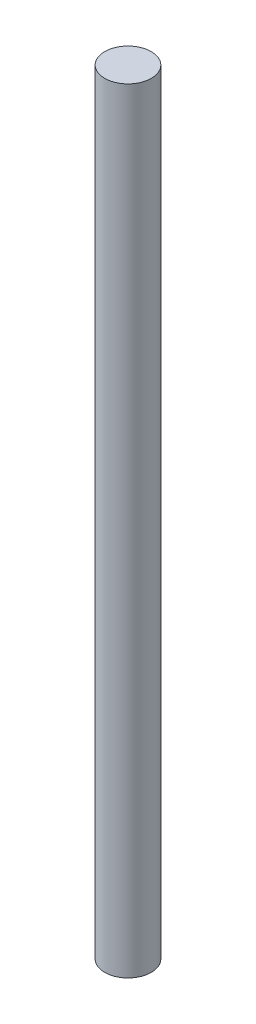
ISO-10303-21;
HEADER;
FILE_DESCRIPTION(('STEP AP214'),'2;1');
FILE_NAME('part.step','',(''),(''),'','','');
FILE_SCHEMA(('AUTOMOTIVE_DESIGN { 1 0 10303 214 1 1 1 1 }'));
ENDSEC;
DATA;
#1=APPLICATION_CONTEXT('core data for automotive mechanical design processes');
#2=APPLICATION_PROTOCOL_DEFINITION('international standard','automotive_design',2000,#1);
#3=PRODUCT_CONTEXT('',#1,'mechanical');
#4=PRODUCT('Part','Part','',(#3));
#5=PRODUCT_RELATED_PRODUCT_CATEGORY('part','',(#4));
#6=PRODUCT_DEFINITION_FORMATION('','',#4);
#7=PRODUCT_DEFINITION_CONTEXT('part definition',#1,'design');
#8=PRODUCT_DEFINITION('design','',#6,#7);
#9=PRODUCT_DEFINITION_SHAPE('','',#8);
#10=(LENGTH_UNIT() NAMED_UNIT(*) SI_UNIT(.MILLI.,.METRE.));
#11=(NAMED_UNIT(*) PLANE_ANGLE_UNIT() SI_UNIT($,.RADIAN.));
#12=(NAMED_UNIT(*) SI_UNIT($,.STERADIAN.) SOLID_ANGLE_UNIT());
#13=UNCERTAINTY_MEASURE_WITH_UNIT(LENGTH_MEASURE(1.E-05),#10,'distance_accuracy_value','');
#14=(GEOMETRIC_REPRESENTATION_CONTEXT(3) GLOBAL_UNCERTAINTY_ASSIGNED_CONTEXT((#13)) GLOBAL_UNIT_ASSIGNED_CONTEXT((#10,
#11,#12)) REPRESENTATION_CONTEXT('',''));
#15=CARTESIAN_POINT('',(0.,0.,0.));
#16=DIRECTION('',(0.,0.,1.));
#17=DIRECTION('',(1.,0.,0.));
#18=AXIS2_PLACEMENT_3D('',#15,#16,#17);
#19=CARTESIAN_POINT('',(0.,10.,0.));
#20=DIRECTION('',(0.,-1.,0.));
#21=DIRECTION('',(0.,0.,-1.));
#22=AXIS2_PLACEMENT_3D('',#19,#20,#21);
#23=CYLINDRICAL_SURFACE('',#22,0.3);
#24=CARTESIAN_POINT('',(0.,10.,0.));
#25=DIRECTION('',(0.,1.,0.));
#26=DIRECTION('',(0.,0.,1.));
#27=AXIS2_PLACEMENT_3D('',#24,#25,#26);
#28=CIRCLE('',#27,0.3);
#29=CARTESIAN_POINT('',(0.,10.,0.3));
#30=VERTEX_POINT('',#29);
#31=EDGE_CURVE('E10',#30,#30,#28,.T.);
#32=ORIENTED_EDGE('',*,*,#31,.F.);
#33=EDGE_LOOP('',(#32));
#34=FACE_BOUND('',#33,.T.);
#35=CARTESIAN_POINT('',(0.,0.,0.));
#36=DIRECTION('',(0.,1.,0.));
#37=DIRECTION('',(0.,0.,1.));
#38=AXIS2_PLACEMENT_3D('',#35,#36,#37);
#39=CIRCLE('',#38,0.3);
#40=CARTESIAN_POINT('',(0.,0.,0.3));
#41=VERTEX_POINT('',#40);
#42=EDGE_CURVE('E34',#41,#41,#39,.T.);
#43=ORIENTED_EDGE('',*,*,#42,.T.);
#44=EDGE_LOOP('',(#43));
#45=FACE_BOUND('',#44,.T.);
#46=ADVANCED_FACE('F31',(#34,#45),#23,.T.);
#47=CARTESIAN_POINT('',(0.,10.,0.));
#48=DIRECTION('',(0.,1.,0.));
#49=DIRECTION('',(0.,0.,1.));
#50=AXIS2_PLACEMENT_3D('',#47,#48,#49);
#51=PLANE('',#50);
#52=ORIENTED_EDGE('',*,*,#31,.T.);
#53=EDGE_LOOP('',(#52));
#54=FACE_BOUND('',#53,.T.);
#55=ADVANCED_FACE('F46',(#54),#51,.T.);
#56=CARTESIAN_POINT('',(0.,0.,0.));
#57=DIRECTION('',(0.,1.,0.));
#58=DIRECTION('',(0.,0.,1.));
#59=AXIS2_PLACEMENT_3D('',#56,#57,#58);
#60=PLANE('',#59);
#61=ORIENTED_EDGE('',*,*,#42,.F.);
#62=EDGE_LOOP('',(#61));
#63=FACE_BOUND('',#62,.T.);
#64=ADVANCED_FACE('F44',(#63),#60,.F.);
#65=CLOSED_SHELL('',(#46,#55,#64));
#66=MANIFOLD_SOLID_BREP('B2',#65);
#67=ADVANCED_BREP_SHAPE_REPRESENTATION('',(#18,#66),#14);
#68=SHAPE_DEFINITION_REPRESENTATION(#9,#67);
ENDSEC;
END-ISO-10303-21;
